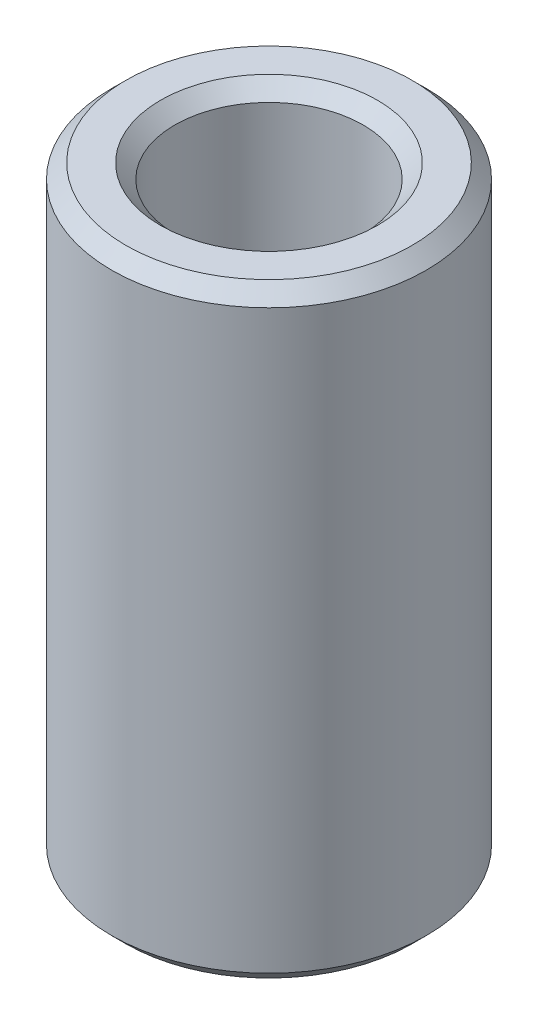
ISO-10303-21;
HEADER;
FILE_DESCRIPTION(('STEP AP214'),'2;1');
FILE_NAME('part.step','',(''),(''),'','','');
FILE_SCHEMA(('AUTOMOTIVE_DESIGN { 1 0 10303 214 1 1 1 1 }'));
ENDSEC;
DATA;
#1=APPLICATION_CONTEXT('core data for automotive mechanical design processes');
#2=APPLICATION_PROTOCOL_DEFINITION('international standard','automotive_design',2000,#1);
#3=PRODUCT_CONTEXT('',#1,'mechanical');
#4=PRODUCT('Part','Part','',(#3));
#5=PRODUCT_RELATED_PRODUCT_CATEGORY('part','',(#4));
#6=PRODUCT_DEFINITION_FORMATION('','',#4);
#7=PRODUCT_DEFINITION_CONTEXT('part definition',#1,'design');
#8=PRODUCT_DEFINITION('design','',#6,#7);
#9=PRODUCT_DEFINITION_SHAPE('','',#8);
#10=(LENGTH_UNIT() NAMED_UNIT(*) SI_UNIT(.MILLI.,.METRE.));
#11=(NAMED_UNIT(*) PLANE_ANGLE_UNIT() SI_UNIT($,.RADIAN.));
#12=(NAMED_UNIT(*) SI_UNIT($,.STERADIAN.) SOLID_ANGLE_UNIT());
#13=UNCERTAINTY_MEASURE_WITH_UNIT(LENGTH_MEASURE(1.E-05),#10,'distance_accuracy_value','');
#14=(GEOMETRIC_REPRESENTATION_CONTEXT(3) GLOBAL_UNCERTAINTY_ASSIGNED_CONTEXT((#13)) GLOBAL_UNIT_ASSIGNED_CONTEXT((#10,
#11,#12)) REPRESENTATION_CONTEXT('',''));
#15=CARTESIAN_POINT('',(0.,0.,0.));
#16=DIRECTION('',(0.,0.,1.));
#17=DIRECTION('',(1.,0.,0.));
#18=AXIS2_PLACEMENT_3D('',#15,#16,#17);
#19=CARTESIAN_POINT('',(0.,57.6517004714564,0.));
#20=DIRECTION('',(0.,-1.,0.));
#21=DIRECTION('',(0.,0.,-1.));
#22=AXIS2_PLACEMENT_3D('',#19,#20,#21);
#23=CYLINDRICAL_SURFACE('',#22,15.);
#24=CARTESIAN_POINT('',(0.,1.36093345836362,0.));
#25=DIRECTION('',(0.,1.,0.));
#26=DIRECTION('',(0.,0.,1.));
#27=AXIS2_PLACEMENT_3D('',#24,#25,#26);
#28=CIRCLE('',#27,15.);
#29=CARTESIAN_POINT('',(0.,1.36093345836362,15.));
#30=VERTEX_POINT('',#29);
#31=EDGE_CURVE('E10',#30,#30,#28,.T.);
#32=ORIENTED_EDGE('',*,*,#31,.T.);
#33=EDGE_LOOP('',(#32));
#34=FACE_BOUND('',#33,.T.);
#35=CARTESIAN_POINT('',(0.,56.2907670130927,0.));
#36=DIRECTION('',(0.,1.,0.));
#37=DIRECTION('',(0.,0.,1.));
#38=AXIS2_PLACEMENT_3D('',#35,#36,#37);
#39=CIRCLE('',#38,15.);
#40=CARTESIAN_POINT('',(0.,56.2907670130927,15.));
#41=VERTEX_POINT('',#40);
#42=EDGE_CURVE('E50',#41,#41,#39,.F.);
#43=ORIENTED_EDGE('',*,*,#42,.T.);
#44=EDGE_LOOP('',(#43));
#45=FACE_BOUND('',#44,.T.);
#46=ADVANCED_FACE('F39',(#34,#45),#23,.T.);
#47=CARTESIAN_POINT('',(0.,57.6517004714564,0.));
#48=DIRECTION('',(0.,1.,0.));
#49=DIRECTION('',(0.,0.,1.));
#50=AXIS2_PLACEMENT_3D('',#47,#48,#49);
#51=PLANE('',#50);
#52=CARTESIAN_POINT('',(0.,57.6517004714564,0.));
#53=DIRECTION('',(0.,1.,0.));
#54=DIRECTION('',(0.,0.,1.));
#55=AXIS2_PLACEMENT_3D('',#52,#53,#54);
#56=CIRCLE('',#55,10.3410822233172);
#57=CARTESIAN_POINT('',(0.,57.6517004714564,10.3410822233172));
#58=VERTEX_POINT('',#57);
#59=EDGE_CURVE('E58',#58,#58,#56,.F.);
#60=ORIENTED_EDGE('',*,*,#59,.T.);
#61=EDGE_LOOP('',(#60));
#62=FACE_BOUND('',#61,.T.);
#63=CARTESIAN_POINT('',(0.,57.6517004714564,0.));
#64=DIRECTION('',(0.,1.,0.));
#65=DIRECTION('',(0.,0.,1.));
#66=AXIS2_PLACEMENT_3D('',#63,#64,#65);
#67=CIRCLE('',#66,13.6390665416364);
#68=CARTESIAN_POINT('',(0.,57.6517004714564,13.6390665416364));
#69=VERTEX_POINT('',#68);
#70=EDGE_CURVE('E61',#69,#69,#67,.T.);
#71=ORIENTED_EDGE('',*,*,#70,.T.);
#72=EDGE_LOOP('',(#71));
#73=FACE_BOUND('',#72,.T.);
#74=ADVANCED_FACE('F88',(#62,#73),#51,.T.);
#75=CARTESIAN_POINT('',(0.,0.,0.));
#76=DIRECTION('',(0.,1.,0.));
#77=DIRECTION('',(0.,0.,1.));
#78=AXIS2_PLACEMENT_3D('',#75,#76,#77);
#79=PLANE('',#78);
#80=CARTESIAN_POINT('',(0.,0.,0.));
#81=DIRECTION('',(0.,1.,0.));
#82=DIRECTION('',(0.,0.,1.));
#83=AXIS2_PLACEMENT_3D('',#80,#81,#82);
#84=CIRCLE('',#83,10.3410822233172);
#85=CARTESIAN_POINT('',(0.,0.,10.3410822233172));
#86=VERTEX_POINT('',#85);
#87=EDGE_CURVE('E51',#86,#86,#84,.T.);
#88=ORIENTED_EDGE('',*,*,#87,.T.);
#89=EDGE_LOOP('',(#88));
#90=FACE_BOUND('',#89,.T.);
#91=CARTESIAN_POINT('',(0.,0.,0.));
#92=DIRECTION('',(0.,1.,0.));
#93=DIRECTION('',(0.,0.,1.));
#94=AXIS2_PLACEMENT_3D('',#91,#92,#93);
#95=CIRCLE('',#94,13.6390665416364);
#96=CARTESIAN_POINT('',(0.,0.,13.6390665416364));
#97=VERTEX_POINT('',#96);
#98=EDGE_CURVE('E54',#97,#97,#95,.F.);
#99=ORIENTED_EDGE('',*,*,#98,.T.);
#100=EDGE_LOOP('',(#99));
#101=FACE_BOUND('',#100,.T.);
#102=ADVANCED_FACE('F83',(#90,#101),#79,.F.);
#103=CARTESIAN_POINT('',(0.,57.6517004714564,0.));
#104=DIRECTION('',(0.,-1.,0.));
#105=DIRECTION('',(0.,0.,-1.));
#106=AXIS2_PLACEMENT_3D('',#103,#104,#105);
#107=CYLINDRICAL_SURFACE('',#106,8.98014876495355);
#108=CARTESIAN_POINT('',(0.,56.2907670130927,0.));
#109=DIRECTION('',(0.,1.,0.));
#110=DIRECTION('',(0.,0.,1.));
#111=AXIS2_PLACEMENT_3D('',#108,#109,#110);
#112=CIRCLE('',#111,8.98014876495355);
#113=CARTESIAN_POINT('',(0.,56.2907670130927,8.98014876495355));
#114=VERTEX_POINT('',#113);
#115=EDGE_CURVE('E67',#114,#114,#112,.T.);
#116=ORIENTED_EDGE('',*,*,#115,.T.);
#117=EDGE_LOOP('',(#116));
#118=FACE_BOUND('',#117,.T.);
#119=CARTESIAN_POINT('',(0.,1.36093345836364,0.));
#120=DIRECTION('',(0.,1.,0.));
#121=DIRECTION('',(0.,0.,1.));
#122=AXIS2_PLACEMENT_3D('',#119,#120,#121);
#123=CIRCLE('',#122,8.98014876495355);
#124=CARTESIAN_POINT('',(0.,1.36093345836364,8.98014876495355));
#125=VERTEX_POINT('',#124);
#126=EDGE_CURVE('E69',#125,#125,#123,.F.);
#127=ORIENTED_EDGE('',*,*,#126,.T.);
#128=EDGE_LOOP('',(#127));
#129=FACE_BOUND('',#128,.T.);
#130=ADVANCED_FACE('F71',(#118,#129),#107,.F.);
#131=CARTESIAN_POINT('',(0.,56.2907670130927,0.));
#132=DIRECTION('',(0.,1.,0.));
#133=DIRECTION('',(0.,0.,1.));
#134=AXIS2_PLACEMENT_3D('',#131,#132,#133);
#135=CONICAL_SURFACE('',#134,8.98014876495355,0.785398163397455);
#136=ORIENTED_EDGE('',*,*,#59,.F.);
#137=EDGE_LOOP('',(#136));
#138=FACE_BOUND('',#137,.T.);
#139=ORIENTED_EDGE('',*,*,#115,.F.);
#140=EDGE_LOOP('',(#139));
#141=FACE_BOUND('',#140,.T.);
#142=ADVANCED_FACE('F77',(#138,#141),#135,.F.);
#143=CARTESIAN_POINT('',(0.,0.,0.));
#144=DIRECTION('',(0.,-1.,0.));
#145=DIRECTION('',(0.,0.,-1.));
#146=AXIS2_PLACEMENT_3D('',#143,#144,#145);
#147=CONICAL_SURFACE('',#146,10.3410822233172,0.785398163397442);
#148=ORIENTED_EDGE('',*,*,#126,.F.);
#149=EDGE_LOOP('',(#148));
#150=FACE_BOUND('',#149,.T.);
#151=ORIENTED_EDGE('',*,*,#87,.F.);
#152=EDGE_LOOP('',(#151));
#153=FACE_BOUND('',#152,.T.);
#154=ADVANCED_FACE('F73',(#150,#153),#147,.F.);
#155=CARTESIAN_POINT('',(0.,1.36093345836362,0.));
#156=DIRECTION('',(0.,1.,0.));
#157=DIRECTION('',(0.,0.,1.));
#158=AXIS2_PLACEMENT_3D('',#155,#156,#157);
#159=CONICAL_SURFACE('',#158,15.,0.785398163397451);
#160=ORIENTED_EDGE('',*,*,#98,.F.);
#161=EDGE_LOOP('',(#160));
#162=FACE_BOUND('',#161,.T.);
#163=ORIENTED_EDGE('',*,*,#31,.F.);
#164=EDGE_LOOP('',(#163));
#165=FACE_BOUND('',#164,.T.);
#166=ADVANCED_FACE('F76',(#162,#165),#159,.T.);
#167=CARTESIAN_POINT('',(0.,57.6517004714564,0.));
#168=DIRECTION('',(0.,-1.,0.));
#169=DIRECTION('',(0.,0.,-1.));
#170=AXIS2_PLACEMENT_3D('',#167,#168,#169);
#171=CONICAL_SURFACE('',#170,13.6390665416364,0.785398163397438);
#172=ORIENTED_EDGE('',*,*,#42,.F.);
#173=EDGE_LOOP('',(#172));
#174=FACE_BOUND('',#173,.T.);
#175=ORIENTED_EDGE('',*,*,#70,.F.);
#176=EDGE_LOOP('',(#175));
#177=FACE_BOUND('',#176,.T.);
#178=ADVANCED_FACE('F45',(#174,#177),#171,.T.);
#179=CLOSED_SHELL('',(#46,#74,#102,#130,#142,#154,#166,#178));
#180=MANIFOLD_SOLID_BREP('B2',#179);
#181=ADVANCED_BREP_SHAPE_REPRESENTATION('',(#18,#180),#14);
#182=SHAPE_DEFINITION_REPRESENTATION(#9,#181);
ENDSEC;
END-ISO-10303-21;
